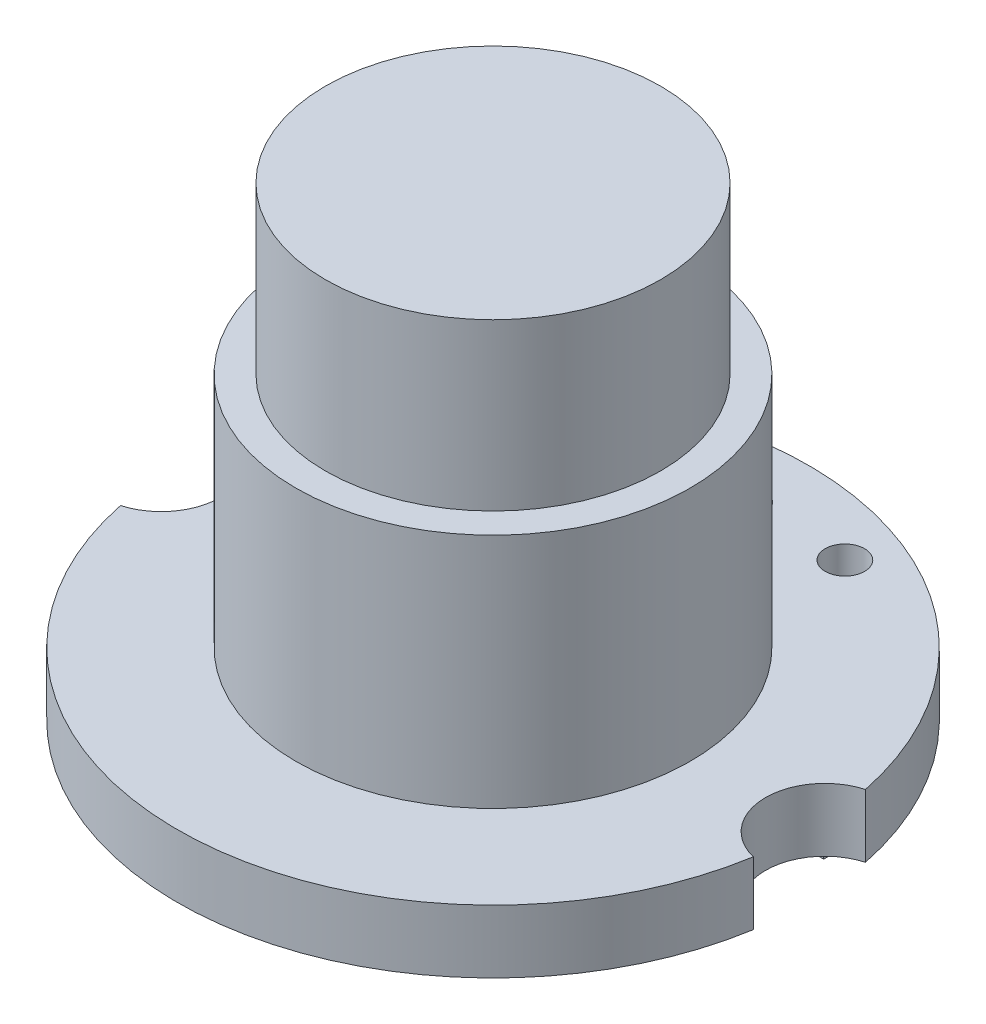
ISO-10303-21;
HEADER;
FILE_DESCRIPTION(('STEP AP214'),'2;1');
FILE_NAME('part.step','',(''),(''),'','','');
FILE_SCHEMA(('AUTOMOTIVE_DESIGN { 1 0 10303 214 1 1 1 1 }'));
ENDSEC;
DATA;
#1=APPLICATION_CONTEXT('core data for automotive mechanical design processes');
#2=APPLICATION_PROTOCOL_DEFINITION('international standard','automotive_design',2000,#1);
#3=PRODUCT_CONTEXT('',#1,'mechanical');
#4=PRODUCT('Part','Part','',(#3));
#5=PRODUCT_RELATED_PRODUCT_CATEGORY('part','',(#4));
#6=PRODUCT_DEFINITION_FORMATION('','',#4);
#7=PRODUCT_DEFINITION_CONTEXT('part definition',#1,'design');
#8=PRODUCT_DEFINITION('design','',#6,#7);
#9=PRODUCT_DEFINITION_SHAPE('','',#8);
#10=(LENGTH_UNIT() NAMED_UNIT(*) SI_UNIT(.MILLI.,.METRE.));
#11=(NAMED_UNIT(*) PLANE_ANGLE_UNIT() SI_UNIT($,.RADIAN.));
#12=(NAMED_UNIT(*) SI_UNIT($,.STERADIAN.) SOLID_ANGLE_UNIT());
#13=UNCERTAINTY_MEASURE_WITH_UNIT(LENGTH_MEASURE(1.E-05),#10,'distance_accuracy_value','');
#14=(GEOMETRIC_REPRESENTATION_CONTEXT(3) GLOBAL_UNCERTAINTY_ASSIGNED_CONTEXT((#13)) GLOBAL_UNIT_ASSIGNED_CONTEXT((#10,
#11,#12)) REPRESENTATION_CONTEXT('',''));
#15=CARTESIAN_POINT('',(0.,0.,0.));
#16=DIRECTION('',(0.,0.,1.));
#17=DIRECTION('',(1.,0.,0.));
#18=AXIS2_PLACEMENT_3D('',#15,#16,#17);
#19=CARTESIAN_POINT('',(0.,1.6,0.));
#20=DIRECTION('',(0.,-1.,0.));
#21=DIRECTION('',(0.,0.,-1.));
#22=AXIS2_PLACEMENT_3D('',#19,#20,#21);
#23=CYLINDRICAL_SURFACE('',#22,8.);
#24=CARTESIAN_POINT('',(0.,0.,0.));
#25=DIRECTION('',(0.,1.,0.));
#26=DIRECTION('',(0.,0.,1.));
#27=AXIS2_PLACEMENT_3D('',#24,#25,#26);
#28=CIRCLE('',#27,8.);
#29=CARTESIAN_POINT('',(-7.83743692649194,0.,1.60455053621271));
#30=VERTEX_POINT('',#29);
#31=CARTESIAN_POINT('',(7.89437962304919,0.,1.29567371169815));
#32=VERTEX_POINT('',#31);
#33=EDGE_CURVE('E162',#30,#32,#28,.T.);
#34=ORIENTED_EDGE('',*,*,#33,.T.);
#35=DIRECTION('',(0.,-1.,0.));
#36=VECTOR('',#35,1.);
#37=CARTESIAN_POINT('',(7.89437962304919,1.6,1.29567371169815));
#38=LINE('',#37,#36);
#39=CARTESIAN_POINT('',(7.89437962304919,1.6,1.29567371169815));
#40=VERTEX_POINT('',#39);
#41=EDGE_CURVE('E166',#40,#32,#38,.T.);
#42=ORIENTED_EDGE('',*,*,#41,.F.);
#43=CARTESIAN_POINT('',(0.,1.6,0.));
#44=DIRECTION('',(0.,1.,0.));
#45=DIRECTION('',(0.,0.,1.));
#46=AXIS2_PLACEMENT_3D('',#43,#44,#45);
#47=CIRCLE('',#46,8.);
#48=CARTESIAN_POINT('',(-7.83743692649194,1.6,1.60455053621271));
#49=VERTEX_POINT('',#48);
#50=EDGE_CURVE('E167',#49,#40,#47,.T.);
#51=ORIENTED_EDGE('',*,*,#50,.F.);
#52=DIRECTION('',(0.,-1.,0.));
#53=VECTOR('',#52,1.);
#54=CARTESIAN_POINT('',(-7.83743692649194,1.6,1.60455053621271));
#55=LINE('',#54,#53);
#56=EDGE_CURVE('E173',#49,#30,#55,.T.);
#57=ORIENTED_EDGE('',*,*,#56,.T.);
#58=EDGE_LOOP('',(#34,#42,#51,#57));
#59=FACE_BOUND('',#58,.T.);
#60=ADVANCED_FACE('F33',(#59),#23,.T.);
#61=CARTESIAN_POINT('',(8.2484103141311,1.6,-0.161948416897622));
#62=DIRECTION('',(0.,-1.,0.));
#63=DIRECTION('',(0.,0.,-1.));
#64=AXIS2_PLACEMENT_3D('',#61,#62,#63);
#65=CYLINDRICAL_SURFACE('',#64,1.5);
#66=CARTESIAN_POINT('',(8.2484103141311,0.,-0.161948416897622));
#67=DIRECTION('',(0.,-1.,0.));
#68=DIRECTION('',(0.,0.,-1.));
#69=AXIS2_PLACEMENT_3D('',#66,#67,#68);
#70=CIRCLE('',#69,1.5);
#71=CARTESIAN_POINT('',(7.83743692649194,0.,-1.60455053621271));
#72=VERTEX_POINT('',#71);
#73=EDGE_CURVE('E176',#32,#72,#70,.T.);
#74=ORIENTED_EDGE('',*,*,#73,.T.);
#75=DIRECTION('',(0.,-1.,0.));
#76=VECTOR('',#75,1.);
#77=CARTESIAN_POINT('',(7.83743692649194,1.6,-1.60455053621271));
#78=LINE('',#77,#76);
#79=CARTESIAN_POINT('',(7.83743692649194,1.6,-1.60455053621271));
#80=VERTEX_POINT('',#79);
#81=EDGE_CURVE('E184',#80,#72,#78,.T.);
#82=ORIENTED_EDGE('',*,*,#81,.F.);
#83=CARTESIAN_POINT('',(8.2484103141311,1.6,-0.161948416897622));
#84=DIRECTION('',(0.,-1.,0.));
#85=DIRECTION('',(0.,0.,-1.));
#86=AXIS2_PLACEMENT_3D('',#83,#84,#85);
#87=CIRCLE('',#86,1.5);
#88=EDGE_CURVE('E85',#40,#80,#87,.T.);
#89=ORIENTED_EDGE('',*,*,#88,.F.);
#90=ORIENTED_EDGE('',*,*,#41,.T.);
#91=EDGE_LOOP('',(#74,#82,#89,#90));
#92=FACE_BOUND('',#91,.T.);
#93=ADVANCED_FACE('F210',(#92),#65,.F.);
#94=CARTESIAN_POINT('',(0.,1.6,0.));
#95=DIRECTION('',(0.,-1.,0.));
#96=DIRECTION('',(0.,0.,-1.));
#97=AXIS2_PLACEMENT_3D('',#94,#95,#96);
#98=CYLINDRICAL_SURFACE('',#97,8.);
#99=CARTESIAN_POINT('',(0.,0.,0.));
#100=DIRECTION('',(0.,1.,0.));
#101=DIRECTION('',(0.,0.,1.));
#102=AXIS2_PLACEMENT_3D('',#99,#100,#101);
#103=CIRCLE('',#102,8.);
#104=CARTESIAN_POINT('',(-7.89437962304919,0.,-1.29567371169814));
#105=VERTEX_POINT('',#104);
#106=EDGE_CURVE('E178',#72,#105,#103,.T.);
#107=ORIENTED_EDGE('',*,*,#106,.T.);
#108=DIRECTION('',(0.,-1.,0.));
#109=VECTOR('',#108,1.);
#110=CARTESIAN_POINT('',(-7.89437962304919,1.6,-1.29567371169814));
#111=LINE('',#110,#109);
#112=CARTESIAN_POINT('',(-7.89437962304919,1.6,-1.29567371169814));
#113=VERTEX_POINT('',#112);
#114=EDGE_CURVE('E182',#113,#105,#111,.T.);
#115=ORIENTED_EDGE('',*,*,#114,.F.);
#116=CARTESIAN_POINT('',(0.,1.6,0.));
#117=DIRECTION('',(0.,1.,0.));
#118=DIRECTION('',(0.,0.,1.));
#119=AXIS2_PLACEMENT_3D('',#116,#117,#118);
#120=CIRCLE('',#119,8.);
#121=EDGE_CURVE('E170',#80,#113,#120,.T.);
#122=ORIENTED_EDGE('',*,*,#121,.F.);
#123=ORIENTED_EDGE('',*,*,#81,.T.);
#124=EDGE_LOOP('',(#107,#115,#122,#123));
#125=FACE_BOUND('',#124,.T.);
#126=ADVANCED_FACE('F215',(#125),#98,.T.);
#127=CARTESIAN_POINT('',(-8.2484103141311,1.6,0.161948416897622));
#128=DIRECTION('',(0.,-1.,0.));
#129=DIRECTION('',(0.,0.,-1.));
#130=AXIS2_PLACEMENT_3D('',#127,#128,#129);
#131=CYLINDRICAL_SURFACE('',#130,1.49999999999999);
#132=CARTESIAN_POINT('',(-8.2484103141311,0.,0.161948416897622));
#133=DIRECTION('',(0.,-1.,0.));
#134=DIRECTION('',(0.,0.,1.));
#135=AXIS2_PLACEMENT_3D('',#132,#133,#134);
#136=CIRCLE('',#135,1.49999999999999);
#137=EDGE_CURVE('E77',#105,#30,#136,.T.);
#138=ORIENTED_EDGE('',*,*,#137,.T.);
#139=ORIENTED_EDGE('',*,*,#56,.F.);
#140=CARTESIAN_POINT('',(-8.2484103141311,1.6,0.161948416897622));
#141=DIRECTION('',(0.,-1.,0.));
#142=DIRECTION('',(0.,0.,1.));
#143=AXIS2_PLACEMENT_3D('',#140,#141,#142);
#144=CIRCLE('',#143,1.49999999999999);
#145=EDGE_CURVE('E56',#113,#49,#144,.T.);
#146=ORIENTED_EDGE('',*,*,#145,.F.);
#147=ORIENTED_EDGE('',*,*,#114,.T.);
#148=EDGE_LOOP('',(#138,#139,#146,#147));
#149=FACE_BOUND('',#148,.T.);
#150=ADVANCED_FACE('F226',(#149),#131,.F.);
#151=CARTESIAN_POINT('',(4.12420515706555,1.6,-0.0809742084488109));
#152=DIRECTION('',(0.,1.,0.));
#153=DIRECTION('',(0.,0.,1.));
#154=AXIS2_PLACEMENT_3D('',#151,#152,#153);
#155=PLANE('',#154);
#156=CARTESIAN_POINT('',(-2.54,1.6,-6.38008704126736));
#157=DIRECTION('',(0.,1.,0.));
#158=DIRECTION('',(0.,0.,1.));
#159=AXIS2_PLACEMENT_3D('',#156,#157,#158);
#160=CIRCLE('',#159,0.5);
#161=CARTESIAN_POINT('',(-2.54,1.6,-5.88008704126736));
#162=VERTEX_POINT('',#161);
#163=EDGE_CURVE('E142',#162,#162,#160,.T.);
#164=ORIENTED_EDGE('',*,*,#163,.F.);
#165=EDGE_LOOP('',(#164));
#166=FACE_BOUND('',#165,.T.);
#167=CARTESIAN_POINT('',(0.,1.6,-6.38008704126736));
#168=DIRECTION('',(0.,1.,0.));
#169=DIRECTION('',(0.,0.,1.));
#170=AXIS2_PLACEMENT_3D('',#167,#168,#169);
#171=CIRCLE('',#170,0.5);
#172=CARTESIAN_POINT('',(0.,1.6,-5.88008704126736));
#173=VERTEX_POINT('',#172);
#174=EDGE_CURVE('E148',#173,#173,#171,.T.);
#175=ORIENTED_EDGE('',*,*,#174,.F.);
#176=EDGE_LOOP('',(#175));
#177=FACE_BOUND('',#176,.T.);
#178=CARTESIAN_POINT('',(2.54,1.6,-6.38008704126736));
#179=DIRECTION('',(0.,1.,0.));
#180=DIRECTION('',(0.,0.,1.));
#181=AXIS2_PLACEMENT_3D('',#178,#179,#180);
#182=CIRCLE('',#181,0.5);
#183=CARTESIAN_POINT('',(2.54,1.6,-5.88008704126736));
#184=VERTEX_POINT('',#183);
#185=EDGE_CURVE('E133',#184,#184,#182,.T.);
#186=ORIENTED_EDGE('',*,*,#185,.F.);
#187=EDGE_LOOP('',(#186));
#188=FACE_BOUND('',#187,.T.);
#189=CARTESIAN_POINT('',(0.,1.6,0.));
#190=DIRECTION('',(0.,1.,0.));
#191=DIRECTION('',(0.,0.,1.));
#192=AXIS2_PLACEMENT_3D('',#189,#190,#191);
#193=CIRCLE('',#192,5.);
#194=CARTESIAN_POINT('',(0.,1.6,5.));
#195=VERTEX_POINT('',#194);
#196=EDGE_CURVE('E163',#195,#195,#193,.T.);
#197=ORIENTED_EDGE('',*,*,#196,.F.);
#198=EDGE_LOOP('',(#197));
#199=FACE_BOUND('',#198,.T.);
#200=ORIENTED_EDGE('',*,*,#50,.T.);
#201=ORIENTED_EDGE('',*,*,#88,.T.);
#202=ORIENTED_EDGE('',*,*,#121,.T.);
#203=ORIENTED_EDGE('',*,*,#145,.T.);
#204=EDGE_LOOP('',(#200,#201,#202,#203));
#205=FACE_BOUND('',#204,.T.);
#206=ADVANCED_FACE('F224',(#166,#177,#188,#199,#205),#155,.T.);
#207=CARTESIAN_POINT('',(4.12420515706555,0.,-0.0809742084488109));
#208=DIRECTION('',(0.,1.,0.));
#209=DIRECTION('',(0.,0.,1.));
#210=AXIS2_PLACEMENT_3D('',#207,#208,#209);
#211=PLANE('',#210);
#212=DIRECTION('',(1.,0.,0.));
#213=VECTOR('',#212,1.);
#214=CARTESIAN_POINT('',(4.12420515706555,0.,-2.84403764801466));
#215=LINE('',#214,#213);
#216=CARTESIAN_POINT('',(4.56319473375491,0.,-2.84403764801466));
#217=VERTEX_POINT('',#216);
#218=CARTESIAN_POINT('',(5.53950616516294,0.,-2.84403764801466));
#219=VERTEX_POINT('',#218);
#220=EDGE_CURVE('E40',#217,#219,#215,.T.);
#221=ORIENTED_EDGE('',*,*,#220,.T.);
#222=DIRECTION('',(0.,0.,-1.));
#223=VECTOR('',#222,1.);
#224=CARTESIAN_POINT('',(5.53950616516294,0.,-0.0809742084488109));
#225=LINE('',#224,#223);
#226=CARTESIAN_POINT('',(5.53950616516294,0.,-4.88155715704011));
#227=VERTEX_POINT('',#226);
#228=EDGE_CURVE('E11',#219,#227,#225,.T.);
#229=ORIENTED_EDGE('',*,*,#228,.T.);
#230=DIRECTION('',(-1.,0.,0.));
#231=VECTOR('',#230,1.);
#232=CARTESIAN_POINT('',(4.12420515706555,0.,-4.88155715704011));
#233=LINE('',#232,#231);
#234=CARTESIAN_POINT('',(4.56319473375491,0.,-4.88155715704011));
#235=VERTEX_POINT('',#234);
#236=EDGE_CURVE('E110',#227,#235,#233,.T.);
#237=ORIENTED_EDGE('',*,*,#236,.T.);
#238=DIRECTION('',(0.,0.,1.));
#239=VECTOR('',#238,1.);
#240=CARTESIAN_POINT('',(4.56319473375491,0.,-0.0809742084488109));
#241=LINE('',#240,#239);
#242=EDGE_CURVE('E191',#235,#217,#241,.T.);
#243=ORIENTED_EDGE('',*,*,#242,.T.);
#244=EDGE_LOOP('',(#221,#229,#237,#243));
#245=FACE_BOUND('',#244,.T.);
#246=CARTESIAN_POINT('',(-2.54,0.,-6.38008704126736));
#247=DIRECTION('',(0.,1.,0.));
#248=DIRECTION('',(0.,0.,1.));
#249=AXIS2_PLACEMENT_3D('',#246,#247,#248);
#250=CIRCLE('',#249,0.5);
#251=CARTESIAN_POINT('',(-2.54,0.,-5.88008704126736));
#252=VERTEX_POINT('',#251);
#253=EDGE_CURVE('E138',#252,#252,#250,.T.);
#254=ORIENTED_EDGE('',*,*,#253,.T.);
#255=EDGE_LOOP('',(#254));
#256=FACE_BOUND('',#255,.T.);
#257=CARTESIAN_POINT('',(0.,0.,-6.38008704126736));
#258=DIRECTION('',(0.,1.,0.));
#259=DIRECTION('',(0.,0.,1.));
#260=AXIS2_PLACEMENT_3D('',#257,#258,#259);
#261=CIRCLE('',#260,0.5);
#262=CARTESIAN_POINT('',(0.,0.,-5.88008704126736));
#263=VERTEX_POINT('',#262);
#264=EDGE_CURVE('E145',#263,#263,#261,.T.);
#265=ORIENTED_EDGE('',*,*,#264,.T.);
#266=EDGE_LOOP('',(#265));
#267=FACE_BOUND('',#266,.T.);
#268=CARTESIAN_POINT('',(2.54,0.,-6.38008704126736));
#269=DIRECTION('',(0.,1.,0.));
#270=DIRECTION('',(0.,0.,1.));
#271=AXIS2_PLACEMENT_3D('',#268,#269,#270);
#272=CIRCLE('',#271,0.5);
#273=CARTESIAN_POINT('',(2.54,0.,-5.88008704126736));
#274=VERTEX_POINT('',#273);
#275=EDGE_CURVE('E151',#274,#274,#272,.T.);
#276=ORIENTED_EDGE('',*,*,#275,.T.);
#277=EDGE_LOOP('',(#276));
#278=FACE_BOUND('',#277,.T.);
#279=ORIENTED_EDGE('',*,*,#33,.F.);
#280=ORIENTED_EDGE('',*,*,#137,.F.);
#281=ORIENTED_EDGE('',*,*,#106,.F.);
#282=ORIENTED_EDGE('',*,*,#73,.F.);
#283=EDGE_LOOP('',(#279,#280,#281,#282));
#284=FACE_BOUND('',#283,.T.);
#285=ADVANCED_FACE('F195',(#245,#256,#267,#278,#284),#211,.F.);
#286=CARTESIAN_POINT('',(0.,7.6,0.));
#287=DIRECTION('',(0.,-1.,0.));
#288=DIRECTION('',(0.,0.,-1.));
#289=AXIS2_PLACEMENT_3D('',#286,#287,#288);
#290=CYLINDRICAL_SURFACE('',#289,5.);
#291=CARTESIAN_POINT('',(0.,7.6,0.));
#292=DIRECTION('',(0.,1.,0.));
#293=DIRECTION('',(0.,0.,1.));
#294=AXIS2_PLACEMENT_3D('',#291,#292,#293);
#295=CIRCLE('',#294,5.);
#296=CARTESIAN_POINT('',(0.,7.6,5.));
#297=VERTEX_POINT('',#296);
#298=EDGE_CURVE('E159',#297,#297,#295,.T.);
#299=ORIENTED_EDGE('',*,*,#298,.F.);
#300=EDGE_LOOP('',(#299));
#301=FACE_BOUND('',#300,.T.);
#302=ORIENTED_EDGE('',*,*,#196,.T.);
#303=EDGE_LOOP('',(#302));
#304=FACE_BOUND('',#303,.T.);
#305=ADVANCED_FACE('F233',(#301,#304),#290,.T.);
#306=CARTESIAN_POINT('',(0.,7.6,0.));
#307=DIRECTION('',(0.,1.,0.));
#308=DIRECTION('',(0.,0.,1.));
#309=AXIS2_PLACEMENT_3D('',#306,#307,#308);
#310=PLANE('',#309);
#311=CARTESIAN_POINT('',(0.,7.6,0.));
#312=DIRECTION('',(0.,1.,0.));
#313=DIRECTION('',(0.,0.,1.));
#314=AXIS2_PLACEMENT_3D('',#311,#312,#313);
#315=CIRCLE('',#314,4.25);
#316=CARTESIAN_POINT('',(0.,7.6,4.25));
#317=VERTEX_POINT('',#316);
#318=EDGE_CURVE('E158',#317,#317,#315,.F.);
#319=ORIENTED_EDGE('',*,*,#318,.T.);
#320=EDGE_LOOP('',(#319));
#321=FACE_BOUND('',#320,.T.);
#322=ORIENTED_EDGE('',*,*,#298,.T.);
#323=EDGE_LOOP('',(#322));
#324=FACE_BOUND('',#323,.T.);
#325=ADVANCED_FACE('F269',(#321,#324),#310,.T.);
#326=CARTESIAN_POINT('',(0.,11.8,0.));
#327=DIRECTION('',(0.,-1.,0.));
#328=DIRECTION('',(0.,0.,-1.));
#329=AXIS2_PLACEMENT_3D('',#326,#327,#328);
#330=CYLINDRICAL_SURFACE('',#329,4.25);
#331=ORIENTED_EDGE('',*,*,#318,.F.);
#332=EDGE_LOOP('',(#331));
#333=FACE_BOUND('',#332,.T.);
#334=CARTESIAN_POINT('',(0.,11.8,0.));
#335=DIRECTION('',(0.,1.,0.));
#336=DIRECTION('',(0.,0.,1.));
#337=AXIS2_PLACEMENT_3D('',#334,#335,#336);
#338=CIRCLE('',#337,4.25);
#339=CARTESIAN_POINT('',(0.,11.8,4.25));
#340=VERTEX_POINT('',#339);
#341=EDGE_CURVE('E141',#340,#340,#338,.T.);
#342=ORIENTED_EDGE('',*,*,#341,.F.);
#343=EDGE_LOOP('',(#342));
#344=FACE_BOUND('',#343,.T.);
#345=ADVANCED_FACE('F275',(#333,#344),#330,.T.);
#346=CARTESIAN_POINT('',(0.,11.8,0.));
#347=DIRECTION('',(0.,1.,0.));
#348=DIRECTION('',(0.,0.,1.));
#349=AXIS2_PLACEMENT_3D('',#346,#347,#348);
#350=PLANE('',#349);
#351=ORIENTED_EDGE('',*,*,#341,.T.);
#352=EDGE_LOOP('',(#351));
#353=FACE_BOUND('',#352,.T.);
#354=ADVANCED_FACE('F282',(#353),#350,.T.);
#355=CARTESIAN_POINT('',(2.54,0.,-6.38008704126736));
#356=DIRECTION('',(0.,1.,0.));
#357=DIRECTION('',(0.,0.,1.));
#358=AXIS2_PLACEMENT_3D('',#355,#356,#357);
#359=CYLINDRICAL_SURFACE('',#358,0.5);
#360=ORIENTED_EDGE('',*,*,#275,.F.);
#361=EDGE_LOOP('',(#360));
#362=FACE_BOUND('',#361,.T.);
#363=ORIENTED_EDGE('',*,*,#185,.T.);
#364=EDGE_LOOP('',(#363));
#365=FACE_BOUND('',#364,.T.);
#366=ADVANCED_FACE('F290',(#362,#365),#359,.F.);
#367=CARTESIAN_POINT('',(0.,0.,-6.38008704126736));
#368=DIRECTION('',(0.,1.,0.));
#369=DIRECTION('',(0.,0.,1.));
#370=AXIS2_PLACEMENT_3D('',#367,#368,#369);
#371=CYLINDRICAL_SURFACE('',#370,0.5);
#372=ORIENTED_EDGE('',*,*,#264,.F.);
#373=EDGE_LOOP('',(#372));
#374=FACE_BOUND('',#373,.T.);
#375=ORIENTED_EDGE('',*,*,#174,.T.);
#376=EDGE_LOOP('',(#375));
#377=FACE_BOUND('',#376,.T.);
#378=ADVANCED_FACE('F298',(#374,#377),#371,.F.);
#379=CARTESIAN_POINT('',(-2.54,0.,-6.38008704126736));
#380=DIRECTION('',(0.,1.,0.));
#381=DIRECTION('',(0.,0.,1.));
#382=AXIS2_PLACEMENT_3D('',#379,#380,#381);
#383=CYLINDRICAL_SURFACE('',#382,0.5);
#384=ORIENTED_EDGE('',*,*,#253,.F.);
#385=EDGE_LOOP('',(#384));
#386=FACE_BOUND('',#385,.T.);
#387=ORIENTED_EDGE('',*,*,#163,.T.);
#388=EDGE_LOOP('',(#387));
#389=FACE_BOUND('',#388,.T.);
#390=ADVANCED_FACE('F306',(#386,#389),#383,.F.);
#391=CARTESIAN_POINT('',(5.53950616516294,-1.7,-0.0809742084488109));
#392=DIRECTION('',(1.,0.,0.));
#393=DIRECTION('',(0.,0.,-1.));
#394=AXIS2_PLACEMENT_3D('',#391,#392,#393);
#395=PLANE('',#394);
#396=ORIENTED_EDGE('',*,*,#228,.F.);
#397=DIRECTION('',(0.,1.,0.));
#398=VECTOR('',#397,1.);
#399=CARTESIAN_POINT('',(5.53950616516294,-1.7,-2.84403764801466));
#400=LINE('',#399,#398);
#401=CARTESIAN_POINT('',(5.53950616516294,-1.7,-2.84403764801466));
#402=VERTEX_POINT('',#401);
#403=EDGE_CURVE('E127',#402,#219,#400,.T.);
#404=ORIENTED_EDGE('',*,*,#403,.F.);
#405=DIRECTION('',(0.,0.,-1.));
#406=VECTOR('',#405,1.);
#407=CARTESIAN_POINT('',(5.53950616516294,-1.7,-0.0809742084488109));
#408=LINE('',#407,#406);
#409=CARTESIAN_POINT('',(5.53950616516294,-1.7,-4.88155715704011));
#410=VERTEX_POINT('',#409);
#411=EDGE_CURVE('E120',#402,#410,#408,.T.);
#412=ORIENTED_EDGE('',*,*,#411,.T.);
#413=DIRECTION('',(0.,1.,0.));
#414=VECTOR('',#413,1.);
#415=CARTESIAN_POINT('',(5.53950616516294,-1.7,-4.88155715704011));
#416=LINE('',#415,#414);
#417=EDGE_CURVE('E105',#410,#227,#416,.T.);
#418=ORIENTED_EDGE('',*,*,#417,.T.);
#419=EDGE_LOOP('',(#396,#404,#412,#418));
#420=FACE_BOUND('',#419,.T.);
#421=ADVANCED_FACE('F125',(#420),#395,.T.);
#422=CARTESIAN_POINT('',(4.12420515706555,-1.7,-2.84403764801466));
#423=DIRECTION('',(0.,0.,1.));
#424=DIRECTION('',(1.,0.,0.));
#425=AXIS2_PLACEMENT_3D('',#422,#423,#424);
#426=PLANE('',#425);
#427=ORIENTED_EDGE('',*,*,#220,.F.);
#428=DIRECTION('',(0.,1.,0.));
#429=VECTOR('',#428,1.);
#430=CARTESIAN_POINT('',(4.56319473375491,-1.7,-2.84403764801466));
#431=LINE('',#430,#429);
#432=CARTESIAN_POINT('',(4.56319473375491,-1.7,-2.84403764801466));
#433=VERTEX_POINT('',#432);
#434=EDGE_CURVE('E134',#433,#217,#431,.T.);
#435=ORIENTED_EDGE('',*,*,#434,.F.);
#436=DIRECTION('',(1.,0.,0.));
#437=VECTOR('',#436,1.);
#438=CARTESIAN_POINT('',(4.12420515706555,-1.7,-2.84403764801466));
#439=LINE('',#438,#437);
#440=EDGE_CURVE('E113',#433,#402,#439,.T.);
#441=ORIENTED_EDGE('',*,*,#440,.T.);
#442=ORIENTED_EDGE('',*,*,#403,.T.);
#443=EDGE_LOOP('',(#427,#435,#441,#442));
#444=FACE_BOUND('',#443,.T.);
#445=ADVANCED_FACE('F198',(#444),#426,.T.);
#446=CARTESIAN_POINT('',(4.56319473375491,-1.7,-0.0809742084488109));
#447=DIRECTION('',(-1.,0.,0.));
#448=DIRECTION('',(0.,0.,1.));
#449=AXIS2_PLACEMENT_3D('',#446,#447,#448);
#450=PLANE('',#449);
#451=ORIENTED_EDGE('',*,*,#242,.F.);
#452=DIRECTION('',(0.,1.,0.));
#453=VECTOR('',#452,1.);
#454=CARTESIAN_POINT('',(4.56319473375491,-1.7,-4.88155715704011));
#455=LINE('',#454,#453);
#456=CARTESIAN_POINT('',(4.56319473375491,-1.7,-4.88155715704011));
#457=VERTEX_POINT('',#456);
#458=EDGE_CURVE('E47',#457,#235,#455,.T.);
#459=ORIENTED_EDGE('',*,*,#458,.F.);
#460=DIRECTION('',(0.,0.,1.));
#461=VECTOR('',#460,1.);
#462=CARTESIAN_POINT('',(4.56319473375491,-1.7,-0.0809742084488109));
#463=LINE('',#462,#461);
#464=EDGE_CURVE('E123',#457,#433,#463,.T.);
#465=ORIENTED_EDGE('',*,*,#464,.T.);
#466=ORIENTED_EDGE('',*,*,#434,.T.);
#467=EDGE_LOOP('',(#451,#459,#465,#466));
#468=FACE_BOUND('',#467,.T.);
#469=ADVANCED_FACE('F200',(#468),#450,.T.);
#470=CARTESIAN_POINT('',(4.12420515706555,-1.7,-4.88155715704011));
#471=DIRECTION('',(0.,0.,-1.));
#472=DIRECTION('',(-1.,0.,0.));
#473=AXIS2_PLACEMENT_3D('',#470,#471,#472);
#474=PLANE('',#473);
#475=ORIENTED_EDGE('',*,*,#236,.F.);
#476=ORIENTED_EDGE('',*,*,#417,.F.);
#477=DIRECTION('',(-1.,0.,0.));
#478=VECTOR('',#477,1.);
#479=CARTESIAN_POINT('',(4.12420515706555,-1.7,-4.88155715704011));
#480=LINE('',#479,#478);
#481=EDGE_CURVE('E108',#410,#457,#480,.T.);
#482=ORIENTED_EDGE('',*,*,#481,.T.);
#483=ORIENTED_EDGE('',*,*,#458,.T.);
#484=EDGE_LOOP('',(#475,#476,#482,#483));
#485=FACE_BOUND('',#484,.T.);
#486=ADVANCED_FACE('F107',(#485),#474,.T.);
#487=CARTESIAN_POINT('',(0.,-1.7,0.));
#488=DIRECTION('',(0.,1.,0.));
#489=DIRECTION('',(0.,0.,1.));
#490=AXIS2_PLACEMENT_3D('',#487,#488,#489);
#491=PLANE('',#490);
#492=ORIENTED_EDGE('',*,*,#411,.F.);
#493=ORIENTED_EDGE('',*,*,#440,.F.);
#494=ORIENTED_EDGE('',*,*,#464,.F.);
#495=ORIENTED_EDGE('',*,*,#481,.F.);
#496=EDGE_LOOP('',(#492,#493,#494,#495));
#497=FACE_BOUND('',#496,.T.);
#498=ADVANCED_FACE('F118',(#497),#491,.F.);
#499=CLOSED_SHELL('',(#60,#93,#126,#150,#206,#285,#305,#325,#345,#354,#366,#378,#390,#421,#445,
#469,#486,#498));
#500=MANIFOLD_SOLID_BREP('B2',#499);
#501=ADVANCED_BREP_SHAPE_REPRESENTATION('',(#18,#500),#14);
#502=SHAPE_DEFINITION_REPRESENTATION(#9,#501);
ENDSEC;
END-ISO-10303-21;
